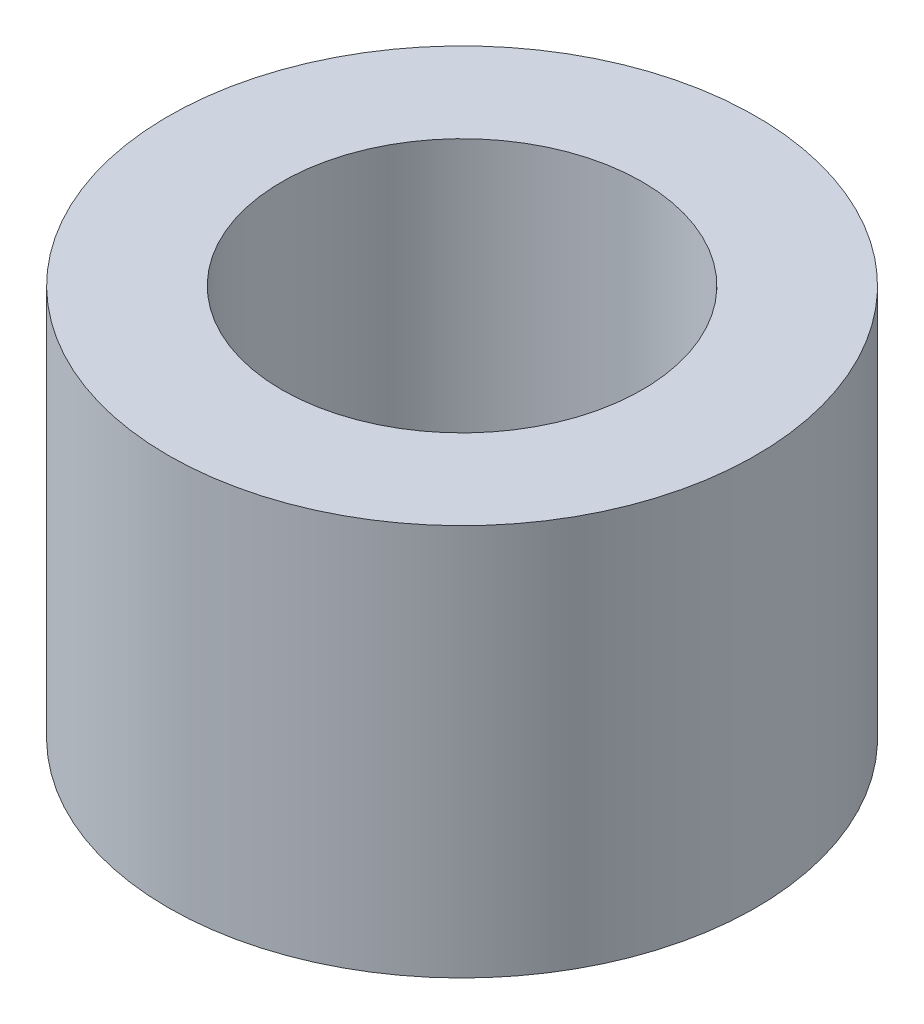
ISO-10303-21;
HEADER;
FILE_DESCRIPTION(('STEP AP214'),'2;1');
FILE_NAME('part.step','',(''),(''),'','','');
FILE_SCHEMA(('AUTOMOTIVE_DESIGN { 1 0 10303 214 1 1 1 1 }'));
ENDSEC;
DATA;
#1=APPLICATION_CONTEXT('core data for automotive mechanical design processes');
#2=APPLICATION_PROTOCOL_DEFINITION('international standard','automotive_design',2000,#1);
#3=PRODUCT_CONTEXT('',#1,'mechanical');
#4=PRODUCT('Part','Part','',(#3));
#5=PRODUCT_RELATED_PRODUCT_CATEGORY('part','',(#4));
#6=PRODUCT_DEFINITION_FORMATION('','',#4);
#7=PRODUCT_DEFINITION_CONTEXT('part definition',#1,'design');
#8=PRODUCT_DEFINITION('design','',#6,#7);
#9=PRODUCT_DEFINITION_SHAPE('','',#8);
#10=(LENGTH_UNIT() NAMED_UNIT(*) SI_UNIT(.MILLI.,.METRE.));
#11=(NAMED_UNIT(*) PLANE_ANGLE_UNIT() SI_UNIT($,.RADIAN.));
#12=(NAMED_UNIT(*) SI_UNIT($,.STERADIAN.) SOLID_ANGLE_UNIT());
#13=UNCERTAINTY_MEASURE_WITH_UNIT(LENGTH_MEASURE(1.E-05),#10,'distance_accuracy_value','');
#14=(GEOMETRIC_REPRESENTATION_CONTEXT(3) GLOBAL_UNCERTAINTY_ASSIGNED_CONTEXT((#13)) GLOBAL_UNIT_ASSIGNED_CONTEXT((#10,
#11,#12)) REPRESENTATION_CONTEXT('',''));
#15=CARTESIAN_POINT('',(0.,0.,0.));
#16=DIRECTION('',(0.,0.,1.));
#17=DIRECTION('',(1.,0.,0.));
#18=AXIS2_PLACEMENT_3D('',#15,#16,#17);
#19=CARTESIAN_POINT('',(0.,3.175,0.));
#20=DIRECTION('',(0.,1.,0.));
#21=DIRECTION('',(0.,0.,1.));
#22=AXIS2_PLACEMENT_3D('',#19,#20,#21);
#23=PLANE('',#22);
#24=CARTESIAN_POINT('',(0.,3.175,0.));
#25=DIRECTION('',(0.,1.,0.));
#26=DIRECTION('',(0.,0.,1.));
#27=AXIS2_PLACEMENT_3D('',#24,#25,#26);
#28=CIRCLE('',#27,2.38125);
#29=CARTESIAN_POINT('',(0.,3.175,2.38125));
#30=VERTEX_POINT('',#29);
#31=EDGE_CURVE('E10',#30,#30,#28,.T.);
#32=ORIENTED_EDGE('',*,*,#31,.T.);
#33=EDGE_LOOP('',(#32));
#34=FACE_BOUND('',#33,.T.);
#35=CARTESIAN_POINT('',(0.,3.175,0.));
#36=DIRECTION('',(0.,1.,0.));
#37=DIRECTION('',(0.,0.,1.));
#38=AXIS2_PLACEMENT_3D('',#35,#36,#37);
#39=CIRCLE('',#38,1.4605);
#40=CARTESIAN_POINT('',(0.,3.175,1.4605));
#41=VERTEX_POINT('',#40);
#42=EDGE_CURVE('E39',#41,#41,#39,.T.);
#43=ORIENTED_EDGE('',*,*,#42,.F.);
#44=EDGE_LOOP('',(#43));
#45=FACE_BOUND('',#44,.T.);
#46=ADVANCED_FACE('F28',(#34,#45),#23,.T.);
#47=CARTESIAN_POINT('',(0.,0.,0.));
#48=DIRECTION('',(0.,1.,0.));
#49=DIRECTION('',(0.,0.,1.));
#50=AXIS2_PLACEMENT_3D('',#47,#48,#49);
#51=PLANE('',#50);
#52=CARTESIAN_POINT('',(0.,0.,0.));
#53=DIRECTION('',(0.,1.,0.));
#54=DIRECTION('',(0.,0.,1.));
#55=AXIS2_PLACEMENT_3D('',#52,#53,#54);
#56=CIRCLE('',#55,2.38125);
#57=CARTESIAN_POINT('',(0.,0.,2.38125));
#58=VERTEX_POINT('',#57);
#59=EDGE_CURVE('E32',#58,#58,#56,.T.);
#60=ORIENTED_EDGE('',*,*,#59,.F.);
#61=EDGE_LOOP('',(#60));
#62=FACE_BOUND('',#61,.T.);
#63=CARTESIAN_POINT('',(0.,0.,0.));
#64=DIRECTION('',(0.,1.,0.));
#65=DIRECTION('',(0.,0.,1.));
#66=AXIS2_PLACEMENT_3D('',#63,#64,#65);
#67=CIRCLE('',#66,1.4605);
#68=CARTESIAN_POINT('',(0.,0.,1.4605));
#69=VERTEX_POINT('',#68);
#70=EDGE_CURVE('E41',#69,#69,#67,.T.);
#71=ORIENTED_EDGE('',*,*,#70,.T.);
#72=EDGE_LOOP('',(#71));
#73=FACE_BOUND('',#72,.T.);
#74=ADVANCED_FACE('F51',(#62,#73),#51,.F.);
#75=CARTESIAN_POINT('',(0.,3.175,0.));
#76=DIRECTION('',(0.,-1.,0.));
#77=DIRECTION('',(0.,0.,-1.));
#78=AXIS2_PLACEMENT_3D('',#75,#76,#77);
#79=CYLINDRICAL_SURFACE('',#78,2.38125);
#80=ORIENTED_EDGE('',*,*,#31,.F.);
#81=EDGE_LOOP('',(#80));
#82=FACE_BOUND('',#81,.T.);
#83=ORIENTED_EDGE('',*,*,#59,.T.);
#84=EDGE_LOOP('',(#83));
#85=FACE_BOUND('',#84,.T.);
#86=ADVANCED_FACE('F30',(#82,#85),#79,.T.);
#87=CARTESIAN_POINT('',(0.,3.175,0.));
#88=DIRECTION('',(0.,-1.,0.));
#89=DIRECTION('',(0.,0.,-1.));
#90=AXIS2_PLACEMENT_3D('',#87,#88,#89);
#91=CYLINDRICAL_SURFACE('',#90,1.4605);
#92=ORIENTED_EDGE('',*,*,#42,.T.);
#93=EDGE_LOOP('',(#92));
#94=FACE_BOUND('',#93,.T.);
#95=ORIENTED_EDGE('',*,*,#70,.F.);
#96=EDGE_LOOP('',(#95));
#97=FACE_BOUND('',#96,.T.);
#98=ADVANCED_FACE('F47',(#94,#97),#91,.F.);
#99=CLOSED_SHELL('',(#46,#74,#86,#98));
#100=MANIFOLD_SOLID_BREP('B2',#99);
#101=ADVANCED_BREP_SHAPE_REPRESENTATION('',(#18,#100),#14);
#102=SHAPE_DEFINITION_REPRESENTATION(#9,#101);
ENDSEC;
END-ISO-10303-21;
